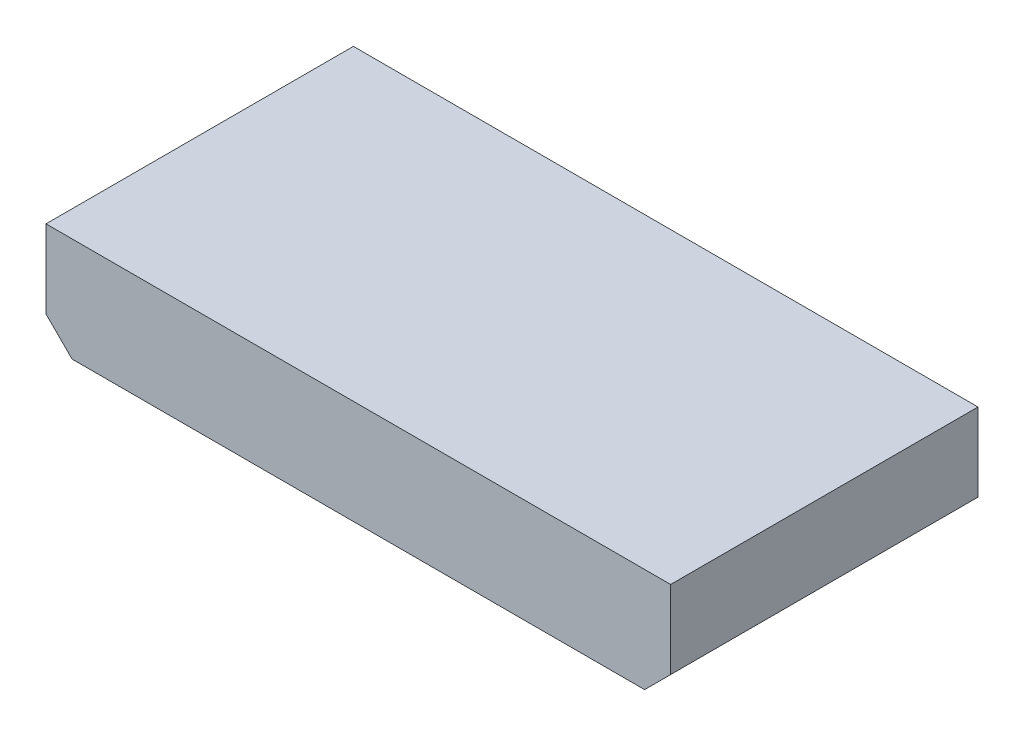
ISO-10303-21;
HEADER;
FILE_DESCRIPTION(('STEP AP214'),'2;1');
FILE_NAME('part.step','',(''),(''),'','','');
FILE_SCHEMA(('AUTOMOTIVE_DESIGN { 1 0 10303 214 1 1 1 1 }'));
ENDSEC;
DATA;
#1=APPLICATION_CONTEXT('core data for automotive mechanical design processes');
#2=APPLICATION_PROTOCOL_DEFINITION('international standard','automotive_design',2000,#1);
#3=PRODUCT_CONTEXT('',#1,'mechanical');
#4=PRODUCT('Part','Part','',(#3));
#5=PRODUCT_RELATED_PRODUCT_CATEGORY('part','',(#4));
#6=PRODUCT_DEFINITION_FORMATION('','',#4);
#7=PRODUCT_DEFINITION_CONTEXT('part definition',#1,'design');
#8=PRODUCT_DEFINITION('design','',#6,#7);
#9=PRODUCT_DEFINITION_SHAPE('','',#8);
#10=(LENGTH_UNIT() NAMED_UNIT(*) SI_UNIT(.MILLI.,.METRE.));
#11=(NAMED_UNIT(*) PLANE_ANGLE_UNIT() SI_UNIT($,.RADIAN.));
#12=(NAMED_UNIT(*) SI_UNIT($,.STERADIAN.) SOLID_ANGLE_UNIT());
#13=UNCERTAINTY_MEASURE_WITH_UNIT(LENGTH_MEASURE(1.E-05),#10,'distance_accuracy_value','');
#14=(GEOMETRIC_REPRESENTATION_CONTEXT(3) GLOBAL_UNCERTAINTY_ASSIGNED_CONTEXT((#13)) GLOBAL_UNIT_ASSIGNED_CONTEXT((#10,
#11,#12)) REPRESENTATION_CONTEXT('',''));
#15=CARTESIAN_POINT('',(0.,0.,0.));
#16=DIRECTION('',(0.,0.,1.));
#17=DIRECTION('',(1.,0.,0.));
#18=AXIS2_PLACEMENT_3D('',#15,#16,#17);
#19=CARTESIAN_POINT('',(20.32,0.,-2.));
#20=DIRECTION('',(0.,0.,1.));
#21=DIRECTION('',(1.,0.,0.));
#22=AXIS2_PLACEMENT_3D('',#19,#20,#21);
#23=CYLINDRICAL_SURFACE('',#22,0.25);
#24=CARTESIAN_POINT('',(20.32,0.,-2.));
#25=DIRECTION('',(0.,0.,1.));
#26=DIRECTION('',(1.,0.,0.));
#27=AXIS2_PLACEMENT_3D('',#24,#25,#26);
#28=CIRCLE('',#27,0.25);
#29=CARTESIAN_POINT('',(20.57,0.,-2.));
#30=VERTEX_POINT('',#29);
#31=EDGE_CURVE('E11',#30,#30,#28,.T.);
#32=ORIENTED_EDGE('',*,*,#31,.T.);
#33=EDGE_LOOP('',(#32));
#34=FACE_BOUND('',#33,.T.);
#35=CARTESIAN_POINT('',(20.32,0.,0.));
#36=DIRECTION('',(0.,0.,1.));
#37=DIRECTION('',(1.,0.,0.));
#38=AXIS2_PLACEMENT_3D('',#35,#36,#37);
#39=CIRCLE('',#38,0.25);
#40=CARTESIAN_POINT('',(20.57,0.,0.));
#41=VERTEX_POINT('',#40);
#42=EDGE_CURVE('E43',#41,#41,#39,.T.);
#43=ORIENTED_EDGE('',*,*,#42,.F.);
#44=EDGE_LOOP('',(#43));
#45=FACE_BOUND('',#44,.T.);
#46=ADVANCED_FACE('F40',(#34,#45),#23,.T.);
#47=CARTESIAN_POINT('',(20.32,0.,-2.));
#48=DIRECTION('',(0.,0.,1.));
#49=DIRECTION('',(1.,0.,0.));
#50=AXIS2_PLACEMENT_3D('',#47,#48,#49);
#51=PLANE('',#50);
#52=ORIENTED_EDGE('',*,*,#31,.F.);
#53=EDGE_LOOP('',(#52));
#54=FACE_BOUND('',#53,.T.);
#55=ADVANCED_FACE('F55',(#54),#51,.F.);
#56=CARTESIAN_POINT('',(20.32,0.,0.));
#57=DIRECTION('',(0.,0.,1.));
#58=DIRECTION('',(1.,0.,0.));
#59=AXIS2_PLACEMENT_3D('',#56,#57,#58);
#60=PLANE('',#59);
#61=ORIENTED_EDGE('',*,*,#42,.T.);
#62=EDGE_LOOP('',(#61));
#63=FACE_BOUND('',#62,.T.);
#64=ADVANCED_FACE('F52',(#63),#60,.T.);
#65=CLOSED_SHELL('',(#46,#55,#64));
#66=MANIFOLD_SOLID_BREP('B2',#65);
#67=CARTESIAN_POINT('',(17.78,0.,-2.));
#68=DIRECTION('',(0.,0.,1.));
#69=DIRECTION('',(1.,0.,0.));
#70=AXIS2_PLACEMENT_3D('',#67,#68,#69);
#71=CYLINDRICAL_SURFACE('',#70,0.25);
#72=CARTESIAN_POINT('',(17.78,0.,-2.));
#73=DIRECTION('',(0.,0.,1.));
#74=DIRECTION('',(1.,0.,0.));
#75=AXIS2_PLACEMENT_3D('',#72,#73,#74);
#76=CIRCLE('',#75,0.25);
#77=CARTESIAN_POINT('',(18.03,0.,-2.));
#78=VERTEX_POINT('',#77);
#79=EDGE_CURVE('E39',#78,#78,#76,.T.);
#80=ORIENTED_EDGE('',*,*,#79,.T.);
#81=EDGE_LOOP('',(#80));
#82=FACE_BOUND('',#81,.T.);
#83=CARTESIAN_POINT('',(17.78,0.,0.));
#84=DIRECTION('',(0.,0.,1.));
#85=DIRECTION('',(1.,0.,0.));
#86=AXIS2_PLACEMENT_3D('',#83,#84,#85);
#87=CIRCLE('',#86,0.25);
#88=CARTESIAN_POINT('',(18.03,0.,0.));
#89=VERTEX_POINT('',#88);
#90=EDGE_CURVE('E92',#89,#89,#87,.T.);
#91=ORIENTED_EDGE('',*,*,#90,.F.);
#92=EDGE_LOOP('',(#91));
#93=FACE_BOUND('',#92,.T.);
#94=ADVANCED_FACE('F89',(#82,#93),#71,.T.);
#95=CARTESIAN_POINT('',(17.78,0.,-2.));
#96=DIRECTION('',(0.,0.,1.));
#97=DIRECTION('',(1.,0.,0.));
#98=AXIS2_PLACEMENT_3D('',#95,#96,#97);
#99=PLANE('',#98);
#100=ORIENTED_EDGE('',*,*,#79,.F.);
#101=EDGE_LOOP('',(#100));
#102=FACE_BOUND('',#101,.T.);
#103=ADVANCED_FACE('F104',(#102),#99,.F.);
#104=CARTESIAN_POINT('',(17.78,0.,0.));
#105=DIRECTION('',(0.,0.,1.));
#106=DIRECTION('',(1.,0.,0.));
#107=AXIS2_PLACEMENT_3D('',#104,#105,#106);
#108=PLANE('',#107);
#109=ORIENTED_EDGE('',*,*,#90,.T.);
#110=EDGE_LOOP('',(#109));
#111=FACE_BOUND('',#110,.T.);
#112=ADVANCED_FACE('F101',(#111),#108,.T.);
#113=CLOSED_SHELL('',(#94,#103,#112));
#114=MANIFOLD_SOLID_BREP('B6',#113);
#115=CARTESIAN_POINT('',(15.24,0.,-2.));
#116=DIRECTION('',(0.,0.,1.));
#117=DIRECTION('',(1.,0.,0.));
#118=AXIS2_PLACEMENT_3D('',#115,#116,#117);
#119=CYLINDRICAL_SURFACE('',#118,0.25);
#120=CARTESIAN_POINT('',(15.24,0.,-2.));
#121=DIRECTION('',(0.,0.,1.));
#122=DIRECTION('',(1.,0.,0.));
#123=AXIS2_PLACEMENT_3D('',#120,#121,#122);
#124=CIRCLE('',#123,0.25);
#125=CARTESIAN_POINT('',(15.49,0.,-2.));
#126=VERTEX_POINT('',#125);
#127=EDGE_CURVE('E88',#126,#126,#124,.T.);
#128=ORIENTED_EDGE('',*,*,#127,.T.);
#129=EDGE_LOOP('',(#128));
#130=FACE_BOUND('',#129,.T.);
#131=CARTESIAN_POINT('',(15.24,0.,0.));
#132=DIRECTION('',(0.,0.,1.));
#133=DIRECTION('',(1.,0.,0.));
#134=AXIS2_PLACEMENT_3D('',#131,#132,#133);
#135=CIRCLE('',#134,0.25);
#136=CARTESIAN_POINT('',(15.49,0.,0.));
#137=VERTEX_POINT('',#136);
#138=EDGE_CURVE('E141',#137,#137,#135,.T.);
#139=ORIENTED_EDGE('',*,*,#138,.F.);
#140=EDGE_LOOP('',(#139));
#141=FACE_BOUND('',#140,.T.);
#142=ADVANCED_FACE('F138',(#130,#141),#119,.T.);
#143=CARTESIAN_POINT('',(15.24,0.,-2.));
#144=DIRECTION('',(0.,0.,1.));
#145=DIRECTION('',(1.,0.,0.));
#146=AXIS2_PLACEMENT_3D('',#143,#144,#145);
#147=PLANE('',#146);
#148=ORIENTED_EDGE('',*,*,#127,.F.);
#149=EDGE_LOOP('',(#148));
#150=FACE_BOUND('',#149,.T.);
#151=ADVANCED_FACE('F153',(#150),#147,.F.);
#152=CARTESIAN_POINT('',(15.24,0.,0.));
#153=DIRECTION('',(0.,0.,1.));
#154=DIRECTION('',(1.,0.,0.));
#155=AXIS2_PLACEMENT_3D('',#152,#153,#154);
#156=PLANE('',#155);
#157=ORIENTED_EDGE('',*,*,#138,.T.);
#158=EDGE_LOOP('',(#157));
#159=FACE_BOUND('',#158,.T.);
#160=ADVANCED_FACE('F150',(#159),#156,.T.);
#161=CLOSED_SHELL('',(#142,#151,#160));
#162=MANIFOLD_SOLID_BREP('B34',#161);
#163=CARTESIAN_POINT('',(12.7,0.,-2.));
#164=DIRECTION('',(0.,0.,1.));
#165=DIRECTION('',(1.,0.,0.));
#166=AXIS2_PLACEMENT_3D('',#163,#164,#165);
#167=CYLINDRICAL_SURFACE('',#166,0.25);
#168=CARTESIAN_POINT('',(12.7,0.,-2.));
#169=DIRECTION('',(0.,0.,1.));
#170=DIRECTION('',(1.,0.,0.));
#171=AXIS2_PLACEMENT_3D('',#168,#169,#170);
#172=CIRCLE('',#171,0.25);
#173=CARTESIAN_POINT('',(12.95,0.,-2.));
#174=VERTEX_POINT('',#173);
#175=EDGE_CURVE('E137',#174,#174,#172,.T.);
#176=ORIENTED_EDGE('',*,*,#175,.T.);
#177=EDGE_LOOP('',(#176));
#178=FACE_BOUND('',#177,.T.);
#179=CARTESIAN_POINT('',(12.7,0.,0.));
#180=DIRECTION('',(0.,0.,1.));
#181=DIRECTION('',(1.,0.,0.));
#182=AXIS2_PLACEMENT_3D('',#179,#180,#181);
#183=CIRCLE('',#182,0.25);
#184=CARTESIAN_POINT('',(12.95,0.,0.));
#185=VERTEX_POINT('',#184);
#186=EDGE_CURVE('E190',#185,#185,#183,.T.);
#187=ORIENTED_EDGE('',*,*,#186,.F.);
#188=EDGE_LOOP('',(#187));
#189=FACE_BOUND('',#188,.T.);
#190=ADVANCED_FACE('F187',(#178,#189),#167,.T.);
#191=CARTESIAN_POINT('',(12.7,0.,-2.));
#192=DIRECTION('',(0.,0.,1.));
#193=DIRECTION('',(1.,0.,0.));
#194=AXIS2_PLACEMENT_3D('',#191,#192,#193);
#195=PLANE('',#194);
#196=ORIENTED_EDGE('',*,*,#175,.F.);
#197=EDGE_LOOP('',(#196));
#198=FACE_BOUND('',#197,.T.);
#199=ADVANCED_FACE('F202',(#198),#195,.F.);
#200=CARTESIAN_POINT('',(12.7,0.,0.));
#201=DIRECTION('',(0.,0.,1.));
#202=DIRECTION('',(1.,0.,0.));
#203=AXIS2_PLACEMENT_3D('',#200,#201,#202);
#204=PLANE('',#203);
#205=ORIENTED_EDGE('',*,*,#186,.T.);
#206=EDGE_LOOP('',(#205));
#207=FACE_BOUND('',#206,.T.);
#208=ADVANCED_FACE('F199',(#207),#204,.T.);
#209=CLOSED_SHELL('',(#190,#199,#208));
#210=MANIFOLD_SOLID_BREP('B83',#209);
#211=CARTESIAN_POINT('',(10.16,0.,-2.));
#212=DIRECTION('',(0.,0.,1.));
#213=DIRECTION('',(1.,0.,0.));
#214=AXIS2_PLACEMENT_3D('',#211,#212,#213);
#215=CYLINDRICAL_SURFACE('',#214,0.25);
#216=CARTESIAN_POINT('',(10.16,0.,-2.));
#217=DIRECTION('',(0.,0.,1.));
#218=DIRECTION('',(1.,0.,0.));
#219=AXIS2_PLACEMENT_3D('',#216,#217,#218);
#220=CIRCLE('',#219,0.25);
#221=CARTESIAN_POINT('',(10.41,0.,-2.));
#222=VERTEX_POINT('',#221);
#223=EDGE_CURVE('E186',#222,#222,#220,.T.);
#224=ORIENTED_EDGE('',*,*,#223,.T.);
#225=EDGE_LOOP('',(#224));
#226=FACE_BOUND('',#225,.T.);
#227=CARTESIAN_POINT('',(10.16,0.,0.));
#228=DIRECTION('',(0.,0.,1.));
#229=DIRECTION('',(1.,0.,0.));
#230=AXIS2_PLACEMENT_3D('',#227,#228,#229);
#231=CIRCLE('',#230,0.25);
#232=CARTESIAN_POINT('',(10.41,0.,0.));
#233=VERTEX_POINT('',#232);
#234=EDGE_CURVE('E239',#233,#233,#231,.T.);
#235=ORIENTED_EDGE('',*,*,#234,.F.);
#236=EDGE_LOOP('',(#235));
#237=FACE_BOUND('',#236,.T.);
#238=ADVANCED_FACE('F236',(#226,#237),#215,.T.);
#239=CARTESIAN_POINT('',(10.16,0.,-2.));
#240=DIRECTION('',(0.,0.,1.));
#241=DIRECTION('',(1.,0.,0.));
#242=AXIS2_PLACEMENT_3D('',#239,#240,#241);
#243=PLANE('',#242);
#244=ORIENTED_EDGE('',*,*,#223,.F.);
#245=EDGE_LOOP('',(#244));
#246=FACE_BOUND('',#245,.T.);
#247=ADVANCED_FACE('F251',(#246),#243,.F.);
#248=CARTESIAN_POINT('',(10.16,0.,0.));
#249=DIRECTION('',(0.,0.,1.));
#250=DIRECTION('',(1.,0.,0.));
#251=AXIS2_PLACEMENT_3D('',#248,#249,#250);
#252=PLANE('',#251);
#253=ORIENTED_EDGE('',*,*,#234,.T.);
#254=EDGE_LOOP('',(#253));
#255=FACE_BOUND('',#254,.T.);
#256=ADVANCED_FACE('F248',(#255),#252,.T.);
#257=CLOSED_SHELL('',(#238,#247,#256));
#258=MANIFOLD_SOLID_BREP('B132',#257);
#259=CARTESIAN_POINT('',(7.62,0.,-2.));
#260=DIRECTION('',(0.,0.,1.));
#261=DIRECTION('',(1.,0.,0.));
#262=AXIS2_PLACEMENT_3D('',#259,#260,#261);
#263=CYLINDRICAL_SURFACE('',#262,0.25);
#264=CARTESIAN_POINT('',(7.62,0.,-2.));
#265=DIRECTION('',(0.,0.,1.));
#266=DIRECTION('',(1.,0.,0.));
#267=AXIS2_PLACEMENT_3D('',#264,#265,#266);
#268=CIRCLE('',#267,0.25);
#269=CARTESIAN_POINT('',(7.87,0.,-2.));
#270=VERTEX_POINT('',#269);
#271=EDGE_CURVE('E235',#270,#270,#268,.T.);
#272=ORIENTED_EDGE('',*,*,#271,.T.);
#273=EDGE_LOOP('',(#272));
#274=FACE_BOUND('',#273,.T.);
#275=CARTESIAN_POINT('',(7.62,0.,0.));
#276=DIRECTION('',(0.,0.,1.));
#277=DIRECTION('',(1.,0.,0.));
#278=AXIS2_PLACEMENT_3D('',#275,#276,#277);
#279=CIRCLE('',#278,0.25);
#280=CARTESIAN_POINT('',(7.87,0.,0.));
#281=VERTEX_POINT('',#280);
#282=EDGE_CURVE('E288',#281,#281,#279,.T.);
#283=ORIENTED_EDGE('',*,*,#282,.F.);
#284=EDGE_LOOP('',(#283));
#285=FACE_BOUND('',#284,.T.);
#286=ADVANCED_FACE('F285',(#274,#285),#263,.T.);
#287=CARTESIAN_POINT('',(7.62,0.,-2.));
#288=DIRECTION('',(0.,0.,1.));
#289=DIRECTION('',(1.,0.,0.));
#290=AXIS2_PLACEMENT_3D('',#287,#288,#289);
#291=PLANE('',#290);
#292=ORIENTED_EDGE('',*,*,#271,.F.);
#293=EDGE_LOOP('',(#292));
#294=FACE_BOUND('',#293,.T.);
#295=ADVANCED_FACE('F300',(#294),#291,.F.);
#296=CARTESIAN_POINT('',(7.62,0.,0.));
#297=DIRECTION('',(0.,0.,1.));
#298=DIRECTION('',(1.,0.,0.));
#299=AXIS2_PLACEMENT_3D('',#296,#297,#298);
#300=PLANE('',#299);
#301=ORIENTED_EDGE('',*,*,#282,.T.);
#302=EDGE_LOOP('',(#301));
#303=FACE_BOUND('',#302,.T.);
#304=ADVANCED_FACE('F297',(#303),#300,.T.);
#305=CLOSED_SHELL('',(#286,#295,#304));
#306=MANIFOLD_SOLID_BREP('B181',#305);
#307=CARTESIAN_POINT('',(5.08,0.,-2.));
#308=DIRECTION('',(0.,0.,1.));
#309=DIRECTION('',(1.,0.,0.));
#310=AXIS2_PLACEMENT_3D('',#307,#308,#309);
#311=CYLINDRICAL_SURFACE('',#310,0.25);
#312=CARTESIAN_POINT('',(5.08,0.,-2.));
#313=DIRECTION('',(0.,0.,1.));
#314=DIRECTION('',(1.,0.,0.));
#315=AXIS2_PLACEMENT_3D('',#312,#313,#314);
#316=CIRCLE('',#315,0.25);
#317=CARTESIAN_POINT('',(5.33,0.,-2.));
#318=VERTEX_POINT('',#317);
#319=EDGE_CURVE('E284',#318,#318,#316,.T.);
#320=ORIENTED_EDGE('',*,*,#319,.T.);
#321=EDGE_LOOP('',(#320));
#322=FACE_BOUND('',#321,.T.);
#323=CARTESIAN_POINT('',(5.08,0.,0.));
#324=DIRECTION('',(0.,0.,1.));
#325=DIRECTION('',(1.,0.,0.));
#326=AXIS2_PLACEMENT_3D('',#323,#324,#325);
#327=CIRCLE('',#326,0.25);
#328=CARTESIAN_POINT('',(5.33,0.,0.));
#329=VERTEX_POINT('',#328);
#330=EDGE_CURVE('E337',#329,#329,#327,.T.);
#331=ORIENTED_EDGE('',*,*,#330,.F.);
#332=EDGE_LOOP('',(#331));
#333=FACE_BOUND('',#332,.T.);
#334=ADVANCED_FACE('F334',(#322,#333),#311,.T.);
#335=CARTESIAN_POINT('',(5.08,0.,-2.));
#336=DIRECTION('',(0.,0.,1.));
#337=DIRECTION('',(1.,0.,0.));
#338=AXIS2_PLACEMENT_3D('',#335,#336,#337);
#339=PLANE('',#338);
#340=ORIENTED_EDGE('',*,*,#319,.F.);
#341=EDGE_LOOP('',(#340));
#342=FACE_BOUND('',#341,.T.);
#343=ADVANCED_FACE('F349',(#342),#339,.F.);
#344=CARTESIAN_POINT('',(5.08,0.,0.));
#345=DIRECTION('',(0.,0.,1.));
#346=DIRECTION('',(1.,0.,0.));
#347=AXIS2_PLACEMENT_3D('',#344,#345,#346);
#348=PLANE('',#347);
#349=ORIENTED_EDGE('',*,*,#330,.T.);
#350=EDGE_LOOP('',(#349));
#351=FACE_BOUND('',#350,.T.);
#352=ADVANCED_FACE('F346',(#351),#348,.T.);
#353=CLOSED_SHELL('',(#334,#343,#352));
#354=MANIFOLD_SOLID_BREP('B230',#353);
#355=CARTESIAN_POINT('',(2.54,0.,-2.));
#356=DIRECTION('',(0.,0.,1.));
#357=DIRECTION('',(1.,0.,0.));
#358=AXIS2_PLACEMENT_3D('',#355,#356,#357);
#359=CYLINDRICAL_SURFACE('',#358,0.25);
#360=CARTESIAN_POINT('',(2.54,0.,-2.));
#361=DIRECTION('',(0.,0.,1.));
#362=DIRECTION('',(1.,0.,0.));
#363=AXIS2_PLACEMENT_3D('',#360,#361,#362);
#364=CIRCLE('',#363,0.25);
#365=CARTESIAN_POINT('',(2.79,0.,-2.));
#366=VERTEX_POINT('',#365);
#367=EDGE_CURVE('E333',#366,#366,#364,.T.);
#368=ORIENTED_EDGE('',*,*,#367,.T.);
#369=EDGE_LOOP('',(#368));
#370=FACE_BOUND('',#369,.T.);
#371=CARTESIAN_POINT('',(2.54,0.,0.));
#372=DIRECTION('',(0.,0.,1.));
#373=DIRECTION('',(1.,0.,0.));
#374=AXIS2_PLACEMENT_3D('',#371,#372,#373);
#375=CIRCLE('',#374,0.25);
#376=CARTESIAN_POINT('',(2.79,0.,0.));
#377=VERTEX_POINT('',#376);
#378=EDGE_CURVE('E386',#377,#377,#375,.T.);
#379=ORIENTED_EDGE('',*,*,#378,.F.);
#380=EDGE_LOOP('',(#379));
#381=FACE_BOUND('',#380,.T.);
#382=ADVANCED_FACE('F383',(#370,#381),#359,.T.);
#383=CARTESIAN_POINT('',(2.54,0.,-2.));
#384=DIRECTION('',(0.,0.,1.));
#385=DIRECTION('',(1.,0.,0.));
#386=AXIS2_PLACEMENT_3D('',#383,#384,#385);
#387=PLANE('',#386);
#388=ORIENTED_EDGE('',*,*,#367,.F.);
#389=EDGE_LOOP('',(#388));
#390=FACE_BOUND('',#389,.T.);
#391=ADVANCED_FACE('F398',(#390),#387,.F.);
#392=CARTESIAN_POINT('',(2.54,0.,0.));
#393=DIRECTION('',(0.,0.,1.));
#394=DIRECTION('',(1.,0.,0.));
#395=AXIS2_PLACEMENT_3D('',#392,#393,#394);
#396=PLANE('',#395);
#397=ORIENTED_EDGE('',*,*,#378,.T.);
#398=EDGE_LOOP('',(#397));
#399=FACE_BOUND('',#398,.T.);
#400=ADVANCED_FACE('F395',(#399),#396,.T.);
#401=CLOSED_SHELL('',(#382,#391,#400));
#402=MANIFOLD_SOLID_BREP('B279',#401);
#403=CARTESIAN_POINT('',(0.,0.,-2.));
#404=DIRECTION('',(0.,0.,1.));
#405=DIRECTION('',(1.,0.,0.));
#406=AXIS2_PLACEMENT_3D('',#403,#404,#405);
#407=CYLINDRICAL_SURFACE('',#406,0.25);
#408=CARTESIAN_POINT('',(0.,0.,-2.));
#409=DIRECTION('',(0.,0.,1.));
#410=DIRECTION('',(1.,0.,0.));
#411=AXIS2_PLACEMENT_3D('',#408,#409,#410);
#412=CIRCLE('',#411,0.25);
#413=CARTESIAN_POINT('',(0.25,0.,-2.));
#414=VERTEX_POINT('',#413);
#415=EDGE_CURVE('E382',#414,#414,#412,.T.);
#416=ORIENTED_EDGE('',*,*,#415,.T.);
#417=EDGE_LOOP('',(#416));
#418=FACE_BOUND('',#417,.T.);
#419=CARTESIAN_POINT('',(0.,0.,0.));
#420=DIRECTION('',(0.,0.,1.));
#421=DIRECTION('',(1.,0.,0.));
#422=AXIS2_PLACEMENT_3D('',#419,#420,#421);
#423=CIRCLE('',#422,0.25);
#424=CARTESIAN_POINT('',(0.25,0.,0.));
#425=VERTEX_POINT('',#424);
#426=EDGE_CURVE('E436',#425,#425,#423,.T.);
#427=ORIENTED_EDGE('',*,*,#426,.F.);
#428=EDGE_LOOP('',(#427));
#429=FACE_BOUND('',#428,.T.);
#430=ADVANCED_FACE('F433',(#418,#429),#407,.T.);
#431=CARTESIAN_POINT('',(0.,0.,-2.));
#432=DIRECTION('',(0.,0.,1.));
#433=DIRECTION('',(1.,0.,0.));
#434=AXIS2_PLACEMENT_3D('',#431,#432,#433);
#435=PLANE('',#434);
#436=ORIENTED_EDGE('',*,*,#415,.F.);
#437=EDGE_LOOP('',(#436));
#438=FACE_BOUND('',#437,.T.);
#439=ADVANCED_FACE('F448',(#438),#435,.F.);
#440=CARTESIAN_POINT('',(0.,0.,0.));
#441=DIRECTION('',(0.,0.,1.));
#442=DIRECTION('',(1.,0.,0.));
#443=AXIS2_PLACEMENT_3D('',#440,#441,#442);
#444=PLANE('',#443);
#445=ORIENTED_EDGE('',*,*,#426,.T.);
#446=EDGE_LOOP('',(#445));
#447=FACE_BOUND('',#446,.T.);
#448=ADVANCED_FACE('F445',(#447),#444,.T.);
#449=CLOSED_SHELL('',(#430,#439,#448));
#450=MANIFOLD_SOLID_BREP('B328',#449);
#451=CARTESIAN_POINT('',(25.4,2.54,15.));
#452=DIRECTION('',(0.,-1.,0.));
#453=DIRECTION('',(0.,0.,-1.));
#454=AXIS2_PLACEMENT_3D('',#451,#452,#453);
#455=PLANE('',#454);
#456=DIRECTION('',(-1.,0.,0.));
#457=VECTOR('',#456,1.);
#458=CARTESIAN_POINT('',(25.4,2.54,0.));
#459=LINE('',#458,#457);
#460=CARTESIAN_POINT('',(25.4,2.54,0.));
#461=VERTEX_POINT('',#460);
#462=CARTESIAN_POINT('',(-5.08,2.54,0.));
#463=VERTEX_POINT('',#462);
#464=EDGE_CURVE('E558',#461,#463,#459,.T.);
#465=ORIENTED_EDGE('',*,*,#464,.T.);
#466=DIRECTION('',(0.,0.,-1.));
#467=VECTOR('',#466,1.);
#468=CARTESIAN_POINT('',(-5.08,2.54,15.));
#469=LINE('',#468,#467);
#470=CARTESIAN_POINT('',(-5.08,2.54,15.));
#471=VERTEX_POINT('',#470);
#472=EDGE_CURVE('E431',#471,#463,#469,.T.);
#473=ORIENTED_EDGE('',*,*,#472,.F.);
#474=DIRECTION('',(-1.,0.,0.));
#475=VECTOR('',#474,1.);
#476=CARTESIAN_POINT('',(25.4,2.54,15.));
#477=LINE('',#476,#475);
#478=CARTESIAN_POINT('',(25.4,2.54,15.));
#479=VERTEX_POINT('',#478);
#480=EDGE_CURVE('E568',#479,#471,#477,.T.);
#481=ORIENTED_EDGE('',*,*,#480,.F.);
#482=DIRECTION('',(0.,0.,-1.));
#483=VECTOR('',#482,1.);
#484=CARTESIAN_POINT('',(25.4,2.54,15.));
#485=LINE('',#484,#483);
#486=EDGE_CURVE('E554',#479,#461,#485,.T.);
#487=ORIENTED_EDGE('',*,*,#486,.T.);
#488=EDGE_LOOP('',(#465,#473,#481,#487));
#489=FACE_BOUND('',#488,.T.);
#490=ADVANCED_FACE('F474',(#489),#455,.F.);
#491=CARTESIAN_POINT('',(-5.08,2.54,15.));
#492=DIRECTION('',(1.,0.,0.));
#493=DIRECTION('',(0.,0.,-1.));
#494=AXIS2_PLACEMENT_3D('',#491,#492,#493);
#495=PLANE('',#494);
#496=DIRECTION('',(0.,-1.,0.));
#497=VECTOR('',#496,1.);
#498=CARTESIAN_POINT('',(-5.08,2.54,0.));
#499=LINE('',#498,#497);
#500=CARTESIAN_POINT('',(-5.08,-1.27,0.));
#501=VERTEX_POINT('',#500);
#502=EDGE_CURVE('E561',#463,#501,#499,.T.);
#503=ORIENTED_EDGE('',*,*,#502,.T.);
#504=DIRECTION('',(0.,0.,-1.));
#505=VECTOR('',#504,1.);
#506=CARTESIAN_POINT('',(-5.08,-1.27,15.));
#507=LINE('',#506,#505);
#508=CARTESIAN_POINT('',(-5.08,-1.27,15.));
#509=VERTEX_POINT('',#508);
#510=EDGE_CURVE('E482',#509,#501,#507,.T.);
#511=ORIENTED_EDGE('',*,*,#510,.F.);
#512=DIRECTION('',(0.,-1.,0.));
#513=VECTOR('',#512,1.);
#514=CARTESIAN_POINT('',(-5.08,2.54,15.));
#515=LINE('',#514,#513);
#516=EDGE_CURVE('E527',#471,#509,#515,.T.);
#517=ORIENTED_EDGE('',*,*,#516,.F.);
#518=ORIENTED_EDGE('',*,*,#472,.T.);
#519=EDGE_LOOP('',(#503,#511,#517,#518));
#520=FACE_BOUND('',#519,.T.);
#521=ADVANCED_FACE('F592',(#520),#495,.F.);
#522=CARTESIAN_POINT('',(-5.08,-1.27,15.));
#523=DIRECTION('',(0.707106781186547,0.707106781186548,0.));
#524=DIRECTION('',(-0.707106781186548,0.707106781186547,0.));
#525=AXIS2_PLACEMENT_3D('',#522,#523,#524);
#526=PLANE('',#525);
#527=DIRECTION('',(0.707106781186548,-0.707106781186547,0.));
#528=VECTOR('',#527,1.);
#529=CARTESIAN_POINT('',(-5.08,-1.27,0.));
#530=LINE('',#529,#528);
#531=CARTESIAN_POINT('',(-3.81,-2.54,0.));
#532=VERTEX_POINT('',#531);
#533=EDGE_CURVE('E563',#501,#532,#530,.T.);
#534=ORIENTED_EDGE('',*,*,#533,.T.);
#535=DIRECTION('',(0.,0.,-1.));
#536=VECTOR('',#535,1.);
#537=CARTESIAN_POINT('',(-3.81,-2.54,15.));
#538=LINE('',#537,#536);
#539=CARTESIAN_POINT('',(-3.81,-2.54,15.));
#540=VERTEX_POINT('',#539);
#541=EDGE_CURVE('E549',#540,#532,#538,.T.);
#542=ORIENTED_EDGE('',*,*,#541,.F.);
#543=DIRECTION('',(0.707106781186548,-0.707106781186547,0.));
#544=VECTOR('',#543,1.);
#545=CARTESIAN_POINT('',(-5.08,-1.27,15.));
#546=LINE('',#545,#544);
#547=EDGE_CURVE('E540',#509,#540,#546,.T.);
#548=ORIENTED_EDGE('',*,*,#547,.F.);
#549=ORIENTED_EDGE('',*,*,#510,.T.);
#550=EDGE_LOOP('',(#534,#542,#548,#549));
#551=FACE_BOUND('',#550,.T.);
#552=ADVANCED_FACE('F574',(#551),#526,.F.);
#553=CARTESIAN_POINT('',(-3.81,-2.54,15.));
#554=DIRECTION('',(0.,1.,0.));
#555=DIRECTION('',(0.,0.,1.));
#556=AXIS2_PLACEMENT_3D('',#553,#554,#555);
#557=PLANE('',#556);
#558=DIRECTION('',(1.,0.,0.));
#559=VECTOR('',#558,1.);
#560=CARTESIAN_POINT('',(-3.81,-2.54,0.));
#561=LINE('',#560,#559);
#562=CARTESIAN_POINT('',(24.13,-2.54,0.));
#563=VERTEX_POINT('',#562);
#564=EDGE_CURVE('E548',#532,#563,#561,.T.);
#565=ORIENTED_EDGE('',*,*,#564,.T.);
#566=DIRECTION('',(0.,0.,-1.));
#567=VECTOR('',#566,1.);
#568=CARTESIAN_POINT('',(24.13,-2.54,15.));
#569=LINE('',#568,#567);
#570=CARTESIAN_POINT('',(24.13,-2.54,15.));
#571=VERTEX_POINT('',#570);
#572=EDGE_CURVE('E545',#571,#563,#569,.T.);
#573=ORIENTED_EDGE('',*,*,#572,.F.);
#574=DIRECTION('',(1.,0.,0.));
#575=VECTOR('',#574,1.);
#576=CARTESIAN_POINT('',(-3.81,-2.54,15.));
#577=LINE('',#576,#575);
#578=EDGE_CURVE('E534',#540,#571,#577,.T.);
#579=ORIENTED_EDGE('',*,*,#578,.F.);
#580=ORIENTED_EDGE('',*,*,#541,.T.);
#581=EDGE_LOOP('',(#565,#573,#579,#580));
#582=FACE_BOUND('',#581,.T.);
#583=ADVANCED_FACE('F546',(#582),#557,.F.);
#584=CARTESIAN_POINT('',(24.13,-2.54,15.));
#585=DIRECTION('',(-0.707106781186547,0.707106781186548,0.));
#586=DIRECTION('',(-0.707106781186548,-0.707106781186547,0.));
#587=AXIS2_PLACEMENT_3D('',#584,#585,#586);
#588=PLANE('',#587);
#589=DIRECTION('',(0.707106781186548,0.707106781186547,0.));
#590=VECTOR('',#589,1.);
#591=CARTESIAN_POINT('',(24.13,-2.54,0.));
#592=LINE('',#591,#590);
#593=CARTESIAN_POINT('',(25.4,-1.27,0.));
#594=VERTEX_POINT('',#593);
#595=EDGE_CURVE('E513',#563,#594,#592,.T.);
#596=ORIENTED_EDGE('',*,*,#595,.T.);
#597=DIRECTION('',(0.,0.,-1.));
#598=VECTOR('',#597,1.);
#599=CARTESIAN_POINT('',(25.4,-1.27,15.));
#600=LINE('',#599,#598);
#601=CARTESIAN_POINT('',(25.4,-1.27,15.));
#602=VERTEX_POINT('',#601);
#603=EDGE_CURVE('E550',#602,#594,#600,.T.);
#604=ORIENTED_EDGE('',*,*,#603,.F.);
#605=DIRECTION('',(0.707106781186548,0.707106781186547,0.));
#606=VECTOR('',#605,1.);
#607=CARTESIAN_POINT('',(24.13,-2.54,15.));
#608=LINE('',#607,#606);
#609=EDGE_CURVE('E538',#571,#602,#608,.T.);
#610=ORIENTED_EDGE('',*,*,#609,.F.);
#611=ORIENTED_EDGE('',*,*,#572,.T.);
#612=EDGE_LOOP('',(#596,#604,#610,#611));
#613=FACE_BOUND('',#612,.T.);
#614=ADVANCED_FACE('F552',(#613),#588,.F.);
#615=CARTESIAN_POINT('',(25.4,-1.27,15.));
#616=DIRECTION('',(-1.,0.,0.));
#617=DIRECTION('',(0.,0.,1.));
#618=AXIS2_PLACEMENT_3D('',#615,#616,#617);
#619=PLANE('',#618);
#620=DIRECTION('',(0.,1.,0.));
#621=VECTOR('',#620,1.);
#622=CARTESIAN_POINT('',(25.4,-1.27,0.));
#623=LINE('',#622,#621);
#624=EDGE_CURVE('E519',#594,#461,#623,.T.);
#625=ORIENTED_EDGE('',*,*,#624,.T.);
#626=ORIENTED_EDGE('',*,*,#486,.F.);
#627=DIRECTION('',(0.,1.,0.));
#628=VECTOR('',#627,1.);
#629=CARTESIAN_POINT('',(25.4,-1.27,15.));
#630=LINE('',#629,#628);
#631=EDGE_CURVE('E490',#602,#479,#630,.T.);
#632=ORIENTED_EDGE('',*,*,#631,.F.);
#633=ORIENTED_EDGE('',*,*,#603,.T.);
#634=EDGE_LOOP('',(#625,#626,#632,#633));
#635=FACE_BOUND('',#634,.T.);
#636=ADVANCED_FACE('F581',(#635),#619,.F.);
#637=CARTESIAN_POINT('',(0.,0.,15.));
#638=DIRECTION('',(0.,0.,1.));
#639=DIRECTION('',(1.,0.,0.));
#640=AXIS2_PLACEMENT_3D('',#637,#638,#639);
#641=PLANE('',#640);
#642=ORIENTED_EDGE('',*,*,#480,.T.);
#643=ORIENTED_EDGE('',*,*,#516,.T.);
#644=ORIENTED_EDGE('',*,*,#547,.T.);
#645=ORIENTED_EDGE('',*,*,#578,.T.);
#646=ORIENTED_EDGE('',*,*,#609,.T.);
#647=ORIENTED_EDGE('',*,*,#631,.T.);
#648=EDGE_LOOP('',(#642,#643,#644,#645,#646,#647));
#649=FACE_BOUND('',#648,.T.);
#650=ADVANCED_FACE('F536',(#649),#641,.T.);
#651=CARTESIAN_POINT('',(0.,0.,0.));
#652=DIRECTION('',(0.,0.,1.));
#653=DIRECTION('',(1.,0.,0.));
#654=AXIS2_PLACEMENT_3D('',#651,#652,#653);
#655=PLANE('',#654);
#656=ORIENTED_EDGE('',*,*,#464,.F.);
#657=ORIENTED_EDGE('',*,*,#624,.F.);
#658=ORIENTED_EDGE('',*,*,#595,.F.);
#659=ORIENTED_EDGE('',*,*,#564,.F.);
#660=ORIENTED_EDGE('',*,*,#533,.F.);
#661=ORIENTED_EDGE('',*,*,#502,.F.);
#662=EDGE_LOOP('',(#656,#657,#658,#659,#660,#661));
#663=FACE_BOUND('',#662,.T.);
#664=ADVANCED_FACE('F577',(#663),#655,.F.);
#665=CLOSED_SHELL('',(#490,#521,#552,#583,#614,#636,#650,#664));
#666=MANIFOLD_SOLID_BREP('B377',#665);
#667=ADVANCED_BREP_SHAPE_REPRESENTATION('',(#18,#66,#114,#162,#210,#258,#306,#354,#402,#450,
#666),#14);
#668=SHAPE_DEFINITION_REPRESENTATION(#9,#667);
ENDSEC;
END-ISO-10303-21;
